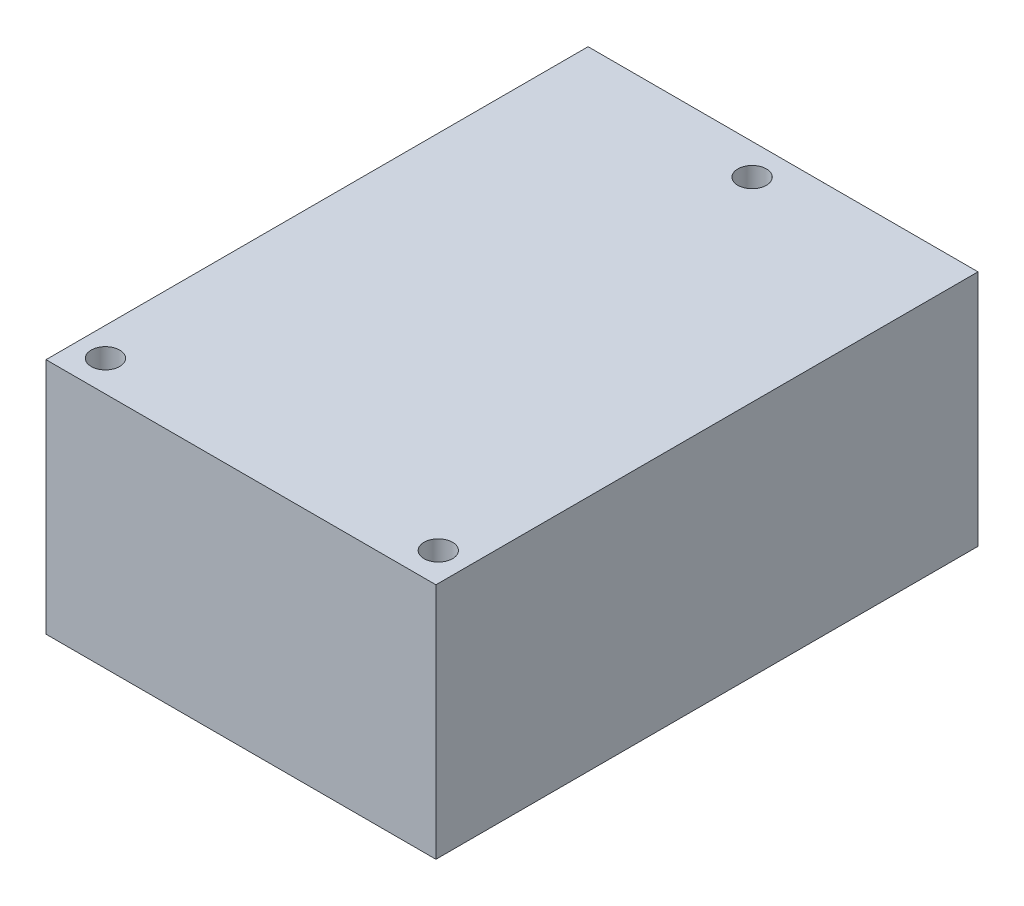
ISO-10303-21;
HEADER;
FILE_DESCRIPTION(('STEP AP214'),'2;1');
FILE_NAME('part.step','',(''),(''),'','','');
FILE_SCHEMA(('AUTOMOTIVE_DESIGN { 1 0 10303 214 1 1 1 1 }'));
ENDSEC;
DATA;
#1=APPLICATION_CONTEXT('core data for automotive mechanical design processes');
#2=APPLICATION_PROTOCOL_DEFINITION('international standard','automotive_design',2000,#1);
#3=PRODUCT_CONTEXT('',#1,'mechanical');
#4=PRODUCT('Part','Part','',(#3));
#5=PRODUCT_RELATED_PRODUCT_CATEGORY('part','',(#4));
#6=PRODUCT_DEFINITION_FORMATION('','',#4);
#7=PRODUCT_DEFINITION_CONTEXT('part definition',#1,'design');
#8=PRODUCT_DEFINITION('design','',#6,#7);
#9=PRODUCT_DEFINITION_SHAPE('','',#8);
#10=(LENGTH_UNIT() NAMED_UNIT(*) SI_UNIT(.MILLI.,.METRE.));
#11=(NAMED_UNIT(*) PLANE_ANGLE_UNIT() SI_UNIT($,.RADIAN.));
#12=(NAMED_UNIT(*) SI_UNIT($,.STERADIAN.) SOLID_ANGLE_UNIT());
#13=UNCERTAINTY_MEASURE_WITH_UNIT(LENGTH_MEASURE(1.E-05),#10,'distance_accuracy_value','');
#14=(GEOMETRIC_REPRESENTATION_CONTEXT(3) GLOBAL_UNCERTAINTY_ASSIGNED_CONTEXT((#13)) GLOBAL_UNIT_ASSIGNED_CONTEXT((#10,
#11,#12)) REPRESENTATION_CONTEXT('',''));
#15=CARTESIAN_POINT('',(0.,0.,0.));
#16=DIRECTION('',(0.,0.,1.));
#17=DIRECTION('',(1.,0.,0.));
#18=AXIS2_PLACEMENT_3D('',#15,#16,#17);
#19=CARTESIAN_POINT('',(20.5,25.,-28.5));
#20=DIRECTION('',(-1.,0.,0.));
#21=DIRECTION('',(0.,0.,1.));
#22=AXIS2_PLACEMENT_3D('',#19,#20,#21);
#23=PLANE('',#22);
#24=DIRECTION('',(0.,0.,-1.));
#25=VECTOR('',#24,1.);
#26=CARTESIAN_POINT('',(20.5,0.,-28.5));
#27=LINE('',#26,#25);
#28=CARTESIAN_POINT('',(20.5,0.,28.5));
#29=VERTEX_POINT('',#28);
#30=CARTESIAN_POINT('',(20.5,0.,-28.5));
#31=VERTEX_POINT('',#30);
#32=EDGE_CURVE('E97',#29,#31,#27,.T.);
#33=ORIENTED_EDGE('',*,*,#32,.T.);
#34=DIRECTION('',(0.,-1.,0.));
#35=VECTOR('',#34,1.);
#36=CARTESIAN_POINT('',(20.5,25.,-28.5));
#37=LINE('',#36,#35);
#38=CARTESIAN_POINT('',(20.5,25.,-28.5));
#39=VERTEX_POINT('',#38);
#40=EDGE_CURVE('E11',#39,#31,#37,.T.);
#41=ORIENTED_EDGE('',*,*,#40,.F.);
#42=DIRECTION('',(0.,0.,-1.));
#43=VECTOR('',#42,1.);
#44=CARTESIAN_POINT('',(20.5,25.,-28.5));
#45=LINE('',#44,#43);
#46=CARTESIAN_POINT('',(20.5,25.,28.5));
#47=VERTEX_POINT('',#46);
#48=EDGE_CURVE('E85',#47,#39,#45,.T.);
#49=ORIENTED_EDGE('',*,*,#48,.F.);
#50=DIRECTION('',(0.,-1.,0.));
#51=VECTOR('',#50,1.);
#52=CARTESIAN_POINT('',(20.5,25.,28.5));
#53=LINE('',#52,#51);
#54=EDGE_CURVE('E93',#47,#29,#53,.T.);
#55=ORIENTED_EDGE('',*,*,#54,.T.);
#56=EDGE_LOOP('',(#33,#41,#49,#55));
#57=FACE_BOUND('',#56,.T.);
#58=ADVANCED_FACE('F34',(#57),#23,.F.);
#59=CARTESIAN_POINT('',(-20.5,25.,-28.5));
#60=DIRECTION('',(0.,0.,1.));
#61=DIRECTION('',(1.,0.,0.));
#62=AXIS2_PLACEMENT_3D('',#59,#60,#61);
#63=PLANE('',#62);
#64=DIRECTION('',(-1.,0.,0.));
#65=VECTOR('',#64,1.);
#66=CARTESIAN_POINT('',(-20.5,0.,-28.5));
#67=LINE('',#66,#65);
#68=CARTESIAN_POINT('',(-20.5,0.,-28.5));
#69=VERTEX_POINT('',#68);
#70=EDGE_CURVE('E89',#31,#69,#67,.T.);
#71=ORIENTED_EDGE('',*,*,#70,.T.);
#72=DIRECTION('',(0.,-1.,0.));
#73=VECTOR('',#72,1.);
#74=CARTESIAN_POINT('',(-20.5,25.,-28.5));
#75=LINE('',#74,#73);
#76=CARTESIAN_POINT('',(-20.5,25.,-28.5));
#77=VERTEX_POINT('',#76);
#78=EDGE_CURVE('E42',#77,#69,#75,.T.);
#79=ORIENTED_EDGE('',*,*,#78,.F.);
#80=DIRECTION('',(-1.,0.,0.));
#81=VECTOR('',#80,1.);
#82=CARTESIAN_POINT('',(-20.5,25.,-28.5));
#83=LINE('',#82,#81);
#84=EDGE_CURVE('E80',#39,#77,#83,.T.);
#85=ORIENTED_EDGE('',*,*,#84,.F.);
#86=ORIENTED_EDGE('',*,*,#40,.T.);
#87=EDGE_LOOP('',(#71,#79,#85,#86));
#88=FACE_BOUND('',#87,.T.);
#89=ADVANCED_FACE('F88',(#88),#63,.F.);
#90=CARTESIAN_POINT('',(-20.5,25.,-28.5));
#91=DIRECTION('',(1.,0.,0.));
#92=DIRECTION('',(0.,0.,-1.));
#93=AXIS2_PLACEMENT_3D('',#90,#91,#92);
#94=PLANE('',#93);
#95=DIRECTION('',(0.,0.,1.));
#96=VECTOR('',#95,1.);
#97=CARTESIAN_POINT('',(-20.5,0.,-28.5));
#98=LINE('',#97,#96);
#99=CARTESIAN_POINT('',(-20.5,0.,28.5));
#100=VERTEX_POINT('',#99);
#101=EDGE_CURVE('E67',#69,#100,#98,.T.);
#102=ORIENTED_EDGE('',*,*,#101,.T.);
#103=DIRECTION('',(0.,-1.,0.));
#104=VECTOR('',#103,1.);
#105=CARTESIAN_POINT('',(-20.5,25.,28.5));
#106=LINE('',#105,#104);
#107=CARTESIAN_POINT('',(-20.5,25.,28.5));
#108=VERTEX_POINT('',#107);
#109=EDGE_CURVE('E90',#108,#100,#106,.T.);
#110=ORIENTED_EDGE('',*,*,#109,.F.);
#111=DIRECTION('',(0.,0.,1.));
#112=VECTOR('',#111,1.);
#113=CARTESIAN_POINT('',(-20.5,25.,-28.5));
#114=LINE('',#113,#112);
#115=EDGE_CURVE('E83',#77,#108,#114,.T.);
#116=ORIENTED_EDGE('',*,*,#115,.F.);
#117=ORIENTED_EDGE('',*,*,#78,.T.);
#118=EDGE_LOOP('',(#102,#110,#116,#117));
#119=FACE_BOUND('',#118,.T.);
#120=ADVANCED_FACE('F91',(#119),#94,.F.);
#121=CARTESIAN_POINT('',(-20.5,25.,28.5));
#122=DIRECTION('',(0.,0.,-1.));
#123=DIRECTION('',(-1.,0.,0.));
#124=AXIS2_PLACEMENT_3D('',#121,#122,#123);
#125=PLANE('',#124);
#126=DIRECTION('',(1.,0.,0.));
#127=VECTOR('',#126,1.);
#128=CARTESIAN_POINT('',(-20.5,0.,28.5));
#129=LINE('',#128,#127);
#130=EDGE_CURVE('E73',#100,#29,#129,.T.);
#131=ORIENTED_EDGE('',*,*,#130,.T.);
#132=ORIENTED_EDGE('',*,*,#54,.F.);
#133=DIRECTION('',(1.,0.,0.));
#134=VECTOR('',#133,1.);
#135=CARTESIAN_POINT('',(-20.5,25.,28.5));
#136=LINE('',#135,#134);
#137=EDGE_CURVE('E50',#108,#47,#136,.T.);
#138=ORIENTED_EDGE('',*,*,#137,.F.);
#139=ORIENTED_EDGE('',*,*,#109,.T.);
#140=EDGE_LOOP('',(#131,#132,#138,#139));
#141=FACE_BOUND('',#140,.T.);
#142=ADVANCED_FACE('F105',(#141),#125,.F.);
#143=CARTESIAN_POINT('',(0.,25.,0.));
#144=DIRECTION('',(0.,1.,0.));
#145=DIRECTION('',(0.,0.,1.));
#146=AXIS2_PLACEMENT_3D('',#143,#144,#145);
#147=PLANE('',#146);
#148=CARTESIAN_POINT('',(0.,25.,-25.25));
#149=DIRECTION('',(0.,1.,0.));
#150=DIRECTION('',(0.,0.,1.));
#151=AXIS2_PLACEMENT_3D('',#148,#149,#150);
#152=CIRCLE('',#151,1.5);
#153=CARTESIAN_POINT('',(0.,25.,-23.75));
#154=VERTEX_POINT('',#153);
#155=EDGE_CURVE('E123',#154,#154,#152,.T.);
#156=ORIENTED_EDGE('',*,*,#155,.F.);
#157=EDGE_LOOP('',(#156));
#158=FACE_BOUND('',#157,.T.);
#159=CARTESIAN_POINT('',(-17.5,25.,25.25));
#160=DIRECTION('',(0.,1.,0.));
#161=DIRECTION('',(0.,0.,1.));
#162=AXIS2_PLACEMENT_3D('',#159,#160,#161);
#163=CIRCLE('',#162,1.5);
#164=CARTESIAN_POINT('',(-17.5,25.,26.75));
#165=VERTEX_POINT('',#164);
#166=EDGE_CURVE('E117',#165,#165,#163,.T.);
#167=ORIENTED_EDGE('',*,*,#166,.F.);
#168=EDGE_LOOP('',(#167));
#169=FACE_BOUND('',#168,.T.);
#170=CARTESIAN_POINT('',(17.5,25.,25.25));
#171=DIRECTION('',(0.,1.,0.));
#172=DIRECTION('',(0.,0.,1.));
#173=AXIS2_PLACEMENT_3D('',#170,#171,#172);
#174=CIRCLE('',#173,1.5);
#175=CARTESIAN_POINT('',(17.5,25.,26.75));
#176=VERTEX_POINT('',#175);
#177=EDGE_CURVE('E111',#176,#176,#174,.T.);
#178=ORIENTED_EDGE('',*,*,#177,.F.);
#179=EDGE_LOOP('',(#178));
#180=FACE_BOUND('',#179,.T.);
#181=ORIENTED_EDGE('',*,*,#48,.T.);
#182=ORIENTED_EDGE('',*,*,#84,.T.);
#183=ORIENTED_EDGE('',*,*,#115,.T.);
#184=ORIENTED_EDGE('',*,*,#137,.T.);
#185=EDGE_LOOP('',(#181,#182,#183,#184));
#186=FACE_BOUND('',#185,.T.);
#187=ADVANCED_FACE('F81',(#158,#169,#180,#186),#147,.T.);
#188=CARTESIAN_POINT('',(0.,0.,0.));
#189=DIRECTION('',(0.,1.,0.));
#190=DIRECTION('',(0.,0.,1.));
#191=AXIS2_PLACEMENT_3D('',#188,#189,#190);
#192=PLANE('',#191);
#193=CARTESIAN_POINT('',(0.,0.,-25.25));
#194=DIRECTION('',(0.,1.,0.));
#195=DIRECTION('',(0.,0.,1.));
#196=AXIS2_PLACEMENT_3D('',#193,#194,#195);
#197=CIRCLE('',#196,1.5);
#198=CARTESIAN_POINT('',(0.,0.,-23.75));
#199=VERTEX_POINT('',#198);
#200=EDGE_CURVE('E100',#199,#199,#197,.T.);
#201=ORIENTED_EDGE('',*,*,#200,.T.);
#202=EDGE_LOOP('',(#201));
#203=FACE_BOUND('',#202,.T.);
#204=CARTESIAN_POINT('',(-17.5,0.,25.25));
#205=DIRECTION('',(0.,1.,0.));
#206=DIRECTION('',(0.,0.,1.));
#207=AXIS2_PLACEMENT_3D('',#204,#205,#206);
#208=CIRCLE('',#207,1.5);
#209=CARTESIAN_POINT('',(-17.5,0.,26.75));
#210=VERTEX_POINT('',#209);
#211=EDGE_CURVE('E120',#210,#210,#208,.T.);
#212=ORIENTED_EDGE('',*,*,#211,.T.);
#213=EDGE_LOOP('',(#212));
#214=FACE_BOUND('',#213,.T.);
#215=CARTESIAN_POINT('',(17.5,0.,25.25));
#216=DIRECTION('',(0.,1.,0.));
#217=DIRECTION('',(0.,0.,1.));
#218=AXIS2_PLACEMENT_3D('',#215,#216,#217);
#219=CIRCLE('',#218,1.5);
#220=CARTESIAN_POINT('',(17.5,0.,26.75));
#221=VERTEX_POINT('',#220);
#222=EDGE_CURVE('E114',#221,#221,#219,.T.);
#223=ORIENTED_EDGE('',*,*,#222,.T.);
#224=EDGE_LOOP('',(#223));
#225=FACE_BOUND('',#224,.T.);
#226=ORIENTED_EDGE('',*,*,#32,.F.);
#227=ORIENTED_EDGE('',*,*,#130,.F.);
#228=ORIENTED_EDGE('',*,*,#101,.F.);
#229=ORIENTED_EDGE('',*,*,#70,.F.);
#230=EDGE_LOOP('',(#226,#227,#228,#229));
#231=FACE_BOUND('',#230,.T.);
#232=ADVANCED_FACE('F108',(#203,#214,#225,#231),#192,.F.);
#233=CARTESIAN_POINT('',(17.5,0.,25.25));
#234=DIRECTION('',(0.,1.,0.));
#235=DIRECTION('',(0.,0.,1.));
#236=AXIS2_PLACEMENT_3D('',#233,#234,#235);
#237=CYLINDRICAL_SURFACE('',#236,1.5);
#238=ORIENTED_EDGE('',*,*,#222,.F.);
#239=EDGE_LOOP('',(#238));
#240=FACE_BOUND('',#239,.T.);
#241=ORIENTED_EDGE('',*,*,#177,.T.);
#242=EDGE_LOOP('',(#241));
#243=FACE_BOUND('',#242,.T.);
#244=ADVANCED_FACE('F145',(#240,#243),#237,.F.);
#245=CARTESIAN_POINT('',(-17.5,0.,25.25));
#246=DIRECTION('',(0.,1.,0.));
#247=DIRECTION('',(0.,0.,1.));
#248=AXIS2_PLACEMENT_3D('',#245,#246,#247);
#249=CYLINDRICAL_SURFACE('',#248,1.5);
#250=ORIENTED_EDGE('',*,*,#211,.F.);
#251=EDGE_LOOP('',(#250));
#252=FACE_BOUND('',#251,.T.);
#253=ORIENTED_EDGE('',*,*,#166,.T.);
#254=EDGE_LOOP('',(#253));
#255=FACE_BOUND('',#254,.T.);
#256=ADVANCED_FACE('F134',(#252,#255),#249,.F.);
#257=CARTESIAN_POINT('',(0.,0.,-25.25));
#258=DIRECTION('',(0.,1.,0.));
#259=DIRECTION('',(0.,0.,1.));
#260=AXIS2_PLACEMENT_3D('',#257,#258,#259);
#261=CYLINDRICAL_SURFACE('',#260,1.5);
#262=ORIENTED_EDGE('',*,*,#200,.F.);
#263=EDGE_LOOP('',(#262));
#264=FACE_BOUND('',#263,.T.);
#265=ORIENTED_EDGE('',*,*,#155,.T.);
#266=EDGE_LOOP('',(#265));
#267=FACE_BOUND('',#266,.T.);
#268=ADVANCED_FACE('F131',(#264,#267),#261,.F.);
#269=CLOSED_SHELL('',(#58,#89,#120,#142,#187,#232,#244,#256,#268));
#270=MANIFOLD_SOLID_BREP('B2',#269);
#271=ADVANCED_BREP_SHAPE_REPRESENTATION('',(#18,#270),#14);
#272=SHAPE_DEFINITION_REPRESENTATION(#9,#271);
ENDSEC;
END-ISO-10303-21;
